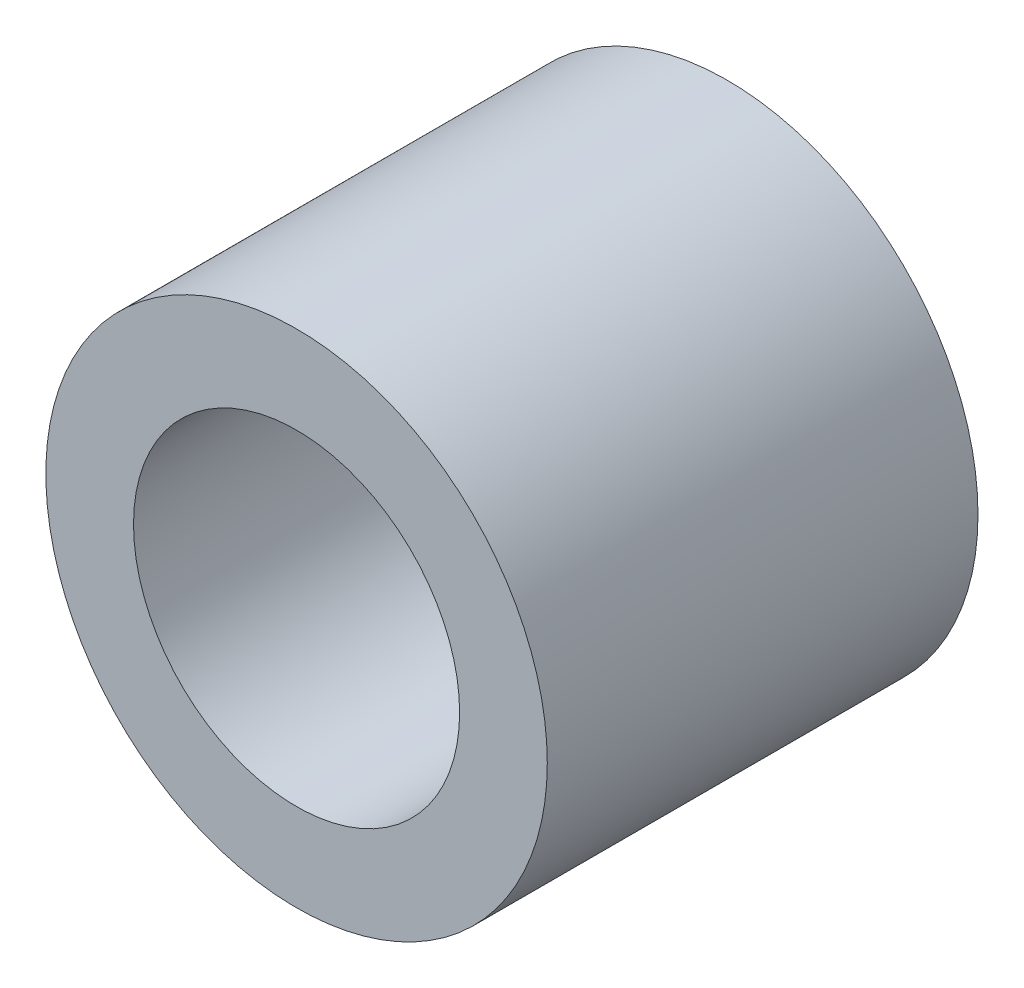
ISO-10303-21;
HEADER;
FILE_DESCRIPTION(('STEP AP214'),'2;1');
FILE_NAME('part.step','',(''),(''),'','','');
FILE_SCHEMA(('AUTOMOTIVE_DESIGN { 1 0 10303 214 1 1 1 1 }'));
ENDSEC;
DATA;
#1=APPLICATION_CONTEXT('core data for automotive mechanical design processes');
#2=APPLICATION_PROTOCOL_DEFINITION('international standard','automotive_design',2000,#1);
#3=PRODUCT_CONTEXT('',#1,'mechanical');
#4=PRODUCT('Part','Part','',(#3));
#5=PRODUCT_RELATED_PRODUCT_CATEGORY('part','',(#4));
#6=PRODUCT_DEFINITION_FORMATION('','',#4);
#7=PRODUCT_DEFINITION_CONTEXT('part definition',#1,'design');
#8=PRODUCT_DEFINITION('design','',#6,#7);
#9=PRODUCT_DEFINITION_SHAPE('','',#8);
#10=(LENGTH_UNIT() NAMED_UNIT(*) SI_UNIT(.MILLI.,.METRE.));
#11=(NAMED_UNIT(*) PLANE_ANGLE_UNIT() SI_UNIT($,.RADIAN.));
#12=(NAMED_UNIT(*) SI_UNIT($,.STERADIAN.) SOLID_ANGLE_UNIT());
#13=UNCERTAINTY_MEASURE_WITH_UNIT(LENGTH_MEASURE(1.E-05),#10,'distance_accuracy_value','');
#14=(GEOMETRIC_REPRESENTATION_CONTEXT(3) GLOBAL_UNCERTAINTY_ASSIGNED_CONTEXT((#13)) GLOBAL_UNIT_ASSIGNED_CONTEXT((#10,
#11,#12)) REPRESENTATION_CONTEXT('',''));
#15=CARTESIAN_POINT('',(0.,0.,0.));
#16=DIRECTION('',(0.,0.,1.));
#17=DIRECTION('',(1.,0.,0.));
#18=AXIS2_PLACEMENT_3D('',#15,#16,#17);
#19=CARTESIAN_POINT('',(0.,0.,7.));
#20=DIRECTION('',(0.,0.,-1.));
#21=DIRECTION('',(-1.,0.,0.));
#22=AXIS2_PLACEMENT_3D('',#19,#20,#21);
#23=CYLINDRICAL_SURFACE('',#22,4.075);
#24=CARTESIAN_POINT('',(0.,0.,7.));
#25=DIRECTION('',(0.,0.,1.));
#26=DIRECTION('',(1.,0.,0.));
#27=AXIS2_PLACEMENT_3D('',#24,#25,#26);
#28=CIRCLE('',#27,4.075);
#29=CARTESIAN_POINT('',(4.075,0.,7.));
#30=VERTEX_POINT('',#29);
#31=EDGE_CURVE('E10',#30,#30,#28,.T.);
#32=ORIENTED_EDGE('',*,*,#31,.F.);
#33=EDGE_LOOP('',(#32));
#34=FACE_BOUND('',#33,.T.);
#35=CARTESIAN_POINT('',(0.,0.,0.));
#36=DIRECTION('',(0.,0.,1.));
#37=DIRECTION('',(1.,0.,0.));
#38=AXIS2_PLACEMENT_3D('',#35,#36,#37);
#39=CIRCLE('',#38,4.075);
#40=CARTESIAN_POINT('',(4.075,0.,0.));
#41=VERTEX_POINT('',#40);
#42=EDGE_CURVE('E46',#41,#41,#39,.T.);
#43=ORIENTED_EDGE('',*,*,#42,.T.);
#44=EDGE_LOOP('',(#43));
#45=FACE_BOUND('',#44,.T.);
#46=ADVANCED_FACE('F43',(#34,#45),#23,.T.);
#47=CARTESIAN_POINT('',(0.,0.,7.));
#48=DIRECTION('',(0.,0.,1.));
#49=DIRECTION('',(1.,0.,0.));
#50=AXIS2_PLACEMENT_3D('',#47,#48,#49);
#51=PLANE('',#50);
#52=CARTESIAN_POINT('',(0.,0.,7.));
#53=DIRECTION('',(0.,0.,1.));
#54=DIRECTION('',(1.,0.,0.));
#55=AXIS2_PLACEMENT_3D('',#52,#53,#54);
#56=CIRCLE('',#55,2.65);
#57=CARTESIAN_POINT('',(2.65,0.,7.));
#58=VERTEX_POINT('',#57);
#59=EDGE_CURVE('E60',#58,#58,#56,.T.);
#60=ORIENTED_EDGE('',*,*,#59,.F.);
#61=EDGE_LOOP('',(#60));
#62=FACE_BOUND('',#61,.T.);
#63=ORIENTED_EDGE('',*,*,#31,.T.);
#64=EDGE_LOOP('',(#63));
#65=FACE_BOUND('',#64,.T.);
#66=ADVANCED_FACE('F67',(#62,#65),#51,.T.);
#67=CARTESIAN_POINT('',(0.,0.,0.));
#68=DIRECTION('',(0.,0.,1.));
#69=DIRECTION('',(1.,0.,0.));
#70=AXIS2_PLACEMENT_3D('',#67,#68,#69);
#71=PLANE('',#70);
#72=CARTESIAN_POINT('',(0.,0.,0.));
#73=DIRECTION('',(0.,0.,1.));
#74=DIRECTION('',(1.,0.,0.));
#75=AXIS2_PLACEMENT_3D('',#72,#73,#74);
#76=CIRCLE('',#75,2.65);
#77=CARTESIAN_POINT('',(2.65,0.,0.));
#78=VERTEX_POINT('',#77);
#79=EDGE_CURVE('E55',#78,#78,#76,.T.);
#80=ORIENTED_EDGE('',*,*,#79,.T.);
#81=EDGE_LOOP('',(#80));
#82=FACE_BOUND('',#81,.T.);
#83=ORIENTED_EDGE('',*,*,#42,.F.);
#84=EDGE_LOOP('',(#83));
#85=FACE_BOUND('',#84,.T.);
#86=ADVANCED_FACE('F69',(#82,#85),#71,.F.);
#87=CARTESIAN_POINT('',(0.,0.,7.));
#88=DIRECTION('',(0.,0.,1.));
#89=DIRECTION('',(1.,0.,0.));
#90=AXIS2_PLACEMENT_3D('',#87,#88,#89);
#91=CYLINDRICAL_SURFACE('',#90,2.65);
#92=ORIENTED_EDGE('',*,*,#79,.F.);
#93=EDGE_LOOP('',(#92));
#94=FACE_BOUND('',#93,.T.);
#95=ORIENTED_EDGE('',*,*,#59,.T.);
#96=EDGE_LOOP('',(#95));
#97=FACE_BOUND('',#96,.T.);
#98=ADVANCED_FACE('F65',(#94,#97),#91,.F.);
#99=CLOSED_SHELL('',(#46,#66,#86,#98));
#100=MANIFOLD_SOLID_BREP('B2',#99);
#101=ADVANCED_BREP_SHAPE_REPRESENTATION('',(#18,#100),#14);
#102=SHAPE_DEFINITION_REPRESENTATION(#9,#101);
ENDSEC;
END-ISO-10303-21;
